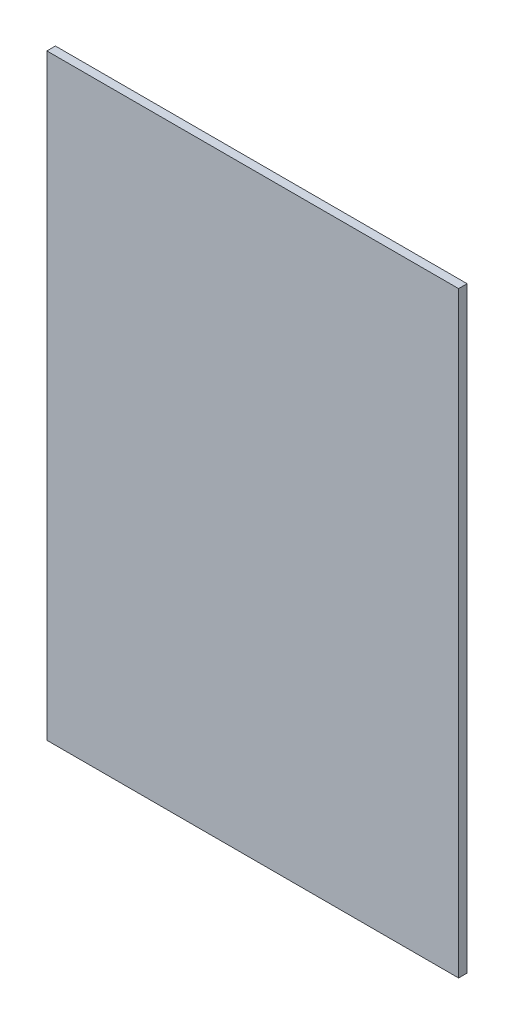
ISO-10303-21;
HEADER;
FILE_DESCRIPTION(('STEP AP214'),'2;1');
FILE_NAME('part.step','',(''),(''),'','','');
FILE_SCHEMA(('AUTOMOTIVE_DESIGN { 1 0 10303 214 1 1 1 1 }'));
ENDSEC;
DATA;
#1=APPLICATION_CONTEXT('core data for automotive mechanical design processes');
#2=APPLICATION_PROTOCOL_DEFINITION('international standard','automotive_design',2000,#1);
#3=PRODUCT_CONTEXT('',#1,'mechanical');
#4=PRODUCT('Part','Part','',(#3));
#5=PRODUCT_RELATED_PRODUCT_CATEGORY('part','',(#4));
#6=PRODUCT_DEFINITION_FORMATION('','',#4);
#7=PRODUCT_DEFINITION_CONTEXT('part definition',#1,'design');
#8=PRODUCT_DEFINITION('design','',#6,#7);
#9=PRODUCT_DEFINITION_SHAPE('','',#8);
#10=(LENGTH_UNIT() NAMED_UNIT(*) SI_UNIT(.MILLI.,.METRE.));
#11=(NAMED_UNIT(*) PLANE_ANGLE_UNIT() SI_UNIT($,.RADIAN.));
#12=(NAMED_UNIT(*) SI_UNIT($,.STERADIAN.) SOLID_ANGLE_UNIT());
#13=UNCERTAINTY_MEASURE_WITH_UNIT(LENGTH_MEASURE(1.E-05),#10,'distance_accuracy_value','');
#14=(GEOMETRIC_REPRESENTATION_CONTEXT(3) GLOBAL_UNCERTAINTY_ASSIGNED_CONTEXT((#13)) GLOBAL_UNIT_ASSIGNED_CONTEXT((#10,
#11,#12)) REPRESENTATION_CONTEXT('',''));
#15=CARTESIAN_POINT('',(0.,0.,0.));
#16=DIRECTION('',(0.,0.,1.));
#17=DIRECTION('',(1.,0.,0.));
#18=AXIS2_PLACEMENT_3D('',#15,#16,#17);
#19=CARTESIAN_POINT('',(11551.2662391642,9708.61629991686,20.));
#20=DIRECTION('',(1.,0.,0.));
#21=DIRECTION('',(0.,0.,-1.));
#22=AXIS2_PLACEMENT_3D('',#19,#20,#21);
#23=PLANE('',#22);
#24=DIRECTION('',(0.,-1.,0.));
#25=VECTOR('',#24,1.);
#26=CARTESIAN_POINT('',(11551.2662391642,9708.61629991686,0.));
#27=LINE('',#26,#25);
#28=CARTESIAN_POINT('',(11551.2662391642,9708.61629991686,0.));
#29=VERTEX_POINT('',#28);
#30=CARTESIAN_POINT('',(11551.2662391642,8306.08117054825,0.));
#31=VERTEX_POINT('',#30);
#32=EDGE_CURVE('E96',#29,#31,#27,.T.);
#33=ORIENTED_EDGE('',*,*,#32,.T.);
#34=DIRECTION('',(0.,0.,-1.));
#35=VECTOR('',#34,1.);
#36=CARTESIAN_POINT('',(11551.2662391642,8306.08117054825,20.));
#37=LINE('',#36,#35);
#38=CARTESIAN_POINT('',(11551.2662391642,8306.08117054825,20.));
#39=VERTEX_POINT('',#38);
#40=EDGE_CURVE('E11',#39,#31,#37,.T.);
#41=ORIENTED_EDGE('',*,*,#40,.F.);
#42=DIRECTION('',(0.,-1.,0.));
#43=VECTOR('',#42,1.);
#44=CARTESIAN_POINT('',(11551.2662391642,9708.61629991686,20.));
#45=LINE('',#44,#43);
#46=CARTESIAN_POINT('',(11551.2662391642,9708.61629991686,20.));
#47=VERTEX_POINT('',#46);
#48=EDGE_CURVE('E84',#47,#39,#45,.T.);
#49=ORIENTED_EDGE('',*,*,#48,.F.);
#50=DIRECTION('',(0.,0.,-1.));
#51=VECTOR('',#50,1.);
#52=CARTESIAN_POINT('',(11551.2662391642,9708.61629991686,20.));
#53=LINE('',#52,#51);
#54=EDGE_CURVE('E92',#47,#29,#53,.T.);
#55=ORIENTED_EDGE('',*,*,#54,.T.);
#56=EDGE_LOOP('',(#33,#41,#49,#55));
#57=FACE_BOUND('',#56,.T.);
#58=ADVANCED_FACE('F33',(#57),#23,.F.);
#59=CARTESIAN_POINT('',(11551.2662391642,8306.08117054825,20.));
#60=DIRECTION('',(0.,1.,0.));
#61=DIRECTION('',(0.,0.,1.));
#62=AXIS2_PLACEMENT_3D('',#59,#60,#61);
#63=PLANE('',#62);
#64=DIRECTION('',(1.,0.,0.));
#65=VECTOR('',#64,1.);
#66=CARTESIAN_POINT('',(11551.2662391642,8306.08117054825,0.));
#67=LINE('',#66,#65);
#68=CARTESIAN_POINT('',(12518.3989794706,8306.08117054825,0.));
#69=VERTEX_POINT('',#68);
#70=EDGE_CURVE('E88',#31,#69,#67,.T.);
#71=ORIENTED_EDGE('',*,*,#70,.T.);
#72=DIRECTION('',(0.,0.,-1.));
#73=VECTOR('',#72,1.);
#74=CARTESIAN_POINT('',(12518.3989794706,8306.08117054825,20.));
#75=LINE('',#74,#73);
#76=CARTESIAN_POINT('',(12518.3989794706,8306.08117054825,20.));
#77=VERTEX_POINT('',#76);
#78=EDGE_CURVE('E41',#77,#69,#75,.T.);
#79=ORIENTED_EDGE('',*,*,#78,.F.);
#80=DIRECTION('',(1.,0.,0.));
#81=VECTOR('',#80,1.);
#82=CARTESIAN_POINT('',(11551.2662391642,8306.08117054825,20.));
#83=LINE('',#82,#81);
#84=EDGE_CURVE('E79',#39,#77,#83,.T.);
#85=ORIENTED_EDGE('',*,*,#84,.F.);
#86=ORIENTED_EDGE('',*,*,#40,.T.);
#87=EDGE_LOOP('',(#71,#79,#85,#86));
#88=FACE_BOUND('',#87,.T.);
#89=ADVANCED_FACE('F87',(#88),#63,.F.);
#90=CARTESIAN_POINT('',(12518.3989794706,9708.61629991686,20.));
#91=DIRECTION('',(-1.,0.,0.));
#92=DIRECTION('',(0.,0.,1.));
#93=AXIS2_PLACEMENT_3D('',#90,#91,#92);
#94=PLANE('',#93);
#95=DIRECTION('',(0.,1.,0.));
#96=VECTOR('',#95,1.);
#97=CARTESIAN_POINT('',(12518.3989794706,9708.61629991686,0.));
#98=LINE('',#97,#96);
#99=CARTESIAN_POINT('',(12518.3989794706,9708.61629991686,0.));
#100=VERTEX_POINT('',#99);
#101=EDGE_CURVE('E66',#69,#100,#98,.T.);
#102=ORIENTED_EDGE('',*,*,#101,.T.);
#103=DIRECTION('',(0.,0.,-1.));
#104=VECTOR('',#103,1.);
#105=CARTESIAN_POINT('',(12518.3989794706,9708.61629991686,20.));
#106=LINE('',#105,#104);
#107=CARTESIAN_POINT('',(12518.3989794706,9708.61629991686,20.));
#108=VERTEX_POINT('',#107);
#109=EDGE_CURVE('E89',#108,#100,#106,.T.);
#110=ORIENTED_EDGE('',*,*,#109,.F.);
#111=DIRECTION('',(0.,1.,0.));
#112=VECTOR('',#111,1.);
#113=CARTESIAN_POINT('',(12518.3989794706,9708.61629991686,20.));
#114=LINE('',#113,#112);
#115=EDGE_CURVE('E82',#77,#108,#114,.T.);
#116=ORIENTED_EDGE('',*,*,#115,.F.);
#117=ORIENTED_EDGE('',*,*,#78,.T.);
#118=EDGE_LOOP('',(#102,#110,#116,#117));
#119=FACE_BOUND('',#118,.T.);
#120=ADVANCED_FACE('F90',(#119),#94,.F.);
#121=CARTESIAN_POINT('',(11551.2662391642,9708.61629991686,20.));
#122=DIRECTION('',(0.,-1.,0.));
#123=DIRECTION('',(0.,0.,-1.));
#124=AXIS2_PLACEMENT_3D('',#121,#122,#123);
#125=PLANE('',#124);
#126=DIRECTION('',(-1.,0.,0.));
#127=VECTOR('',#126,1.);
#128=CARTESIAN_POINT('',(11551.2662391642,9708.61629991686,0.));
#129=LINE('',#128,#127);
#130=EDGE_CURVE('E72',#100,#29,#129,.T.);
#131=ORIENTED_EDGE('',*,*,#130,.T.);
#132=ORIENTED_EDGE('',*,*,#54,.F.);
#133=DIRECTION('',(-1.,0.,0.));
#134=VECTOR('',#133,1.);
#135=CARTESIAN_POINT('',(11551.2662391642,9708.61629991686,20.));
#136=LINE('',#135,#134);
#137=EDGE_CURVE('E49',#108,#47,#136,.T.);
#138=ORIENTED_EDGE('',*,*,#137,.F.);
#139=ORIENTED_EDGE('',*,*,#109,.T.);
#140=EDGE_LOOP('',(#131,#132,#138,#139));
#141=FACE_BOUND('',#140,.T.);
#142=ADVANCED_FACE('F103',(#141),#125,.F.);
#143=CARTESIAN_POINT('',(0.,0.,20.));
#144=DIRECTION('',(0.,0.,1.));
#145=DIRECTION('',(1.,0.,0.));
#146=AXIS2_PLACEMENT_3D('',#143,#144,#145);
#147=PLANE('',#146);
#148=ORIENTED_EDGE('',*,*,#48,.T.);
#149=ORIENTED_EDGE('',*,*,#84,.T.);
#150=ORIENTED_EDGE('',*,*,#115,.T.);
#151=ORIENTED_EDGE('',*,*,#137,.T.);
#152=EDGE_LOOP('',(#148,#149,#150,#151));
#153=FACE_BOUND('',#152,.T.);
#154=ADVANCED_FACE('F80',(#153),#147,.T.);
#155=CARTESIAN_POINT('',(0.,0.,0.));
#156=DIRECTION('',(0.,0.,1.));
#157=DIRECTION('',(1.,0.,0.));
#158=AXIS2_PLACEMENT_3D('',#155,#156,#157);
#159=PLANE('',#158);
#160=ORIENTED_EDGE('',*,*,#32,.F.);
#161=ORIENTED_EDGE('',*,*,#130,.F.);
#162=ORIENTED_EDGE('',*,*,#101,.F.);
#163=ORIENTED_EDGE('',*,*,#70,.F.);
#164=EDGE_LOOP('',(#160,#161,#162,#163));
#165=FACE_BOUND('',#164,.T.);
#166=ADVANCED_FACE('F106',(#165),#159,.F.);
#167=CLOSED_SHELL('',(#58,#89,#120,#142,#154,#166));
#168=MANIFOLD_SOLID_BREP('B2',#167);
#169=ADVANCED_BREP_SHAPE_REPRESENTATION('',(#18,#168),#14);
#170=SHAPE_DEFINITION_REPRESENTATION(#9,#169);
ENDSEC;
END-ISO-10303-21;
